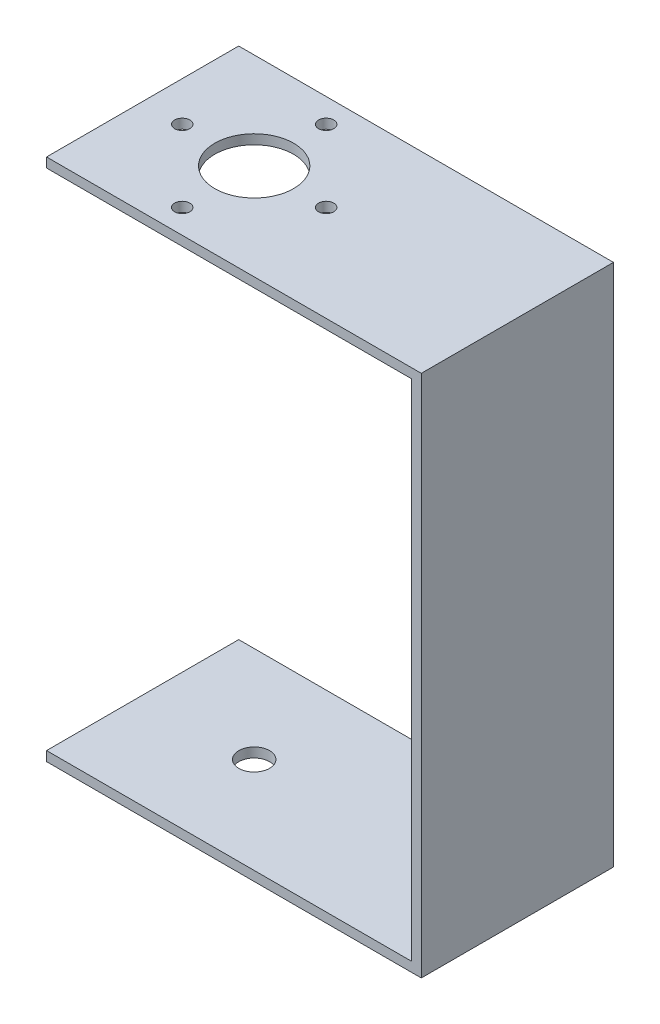
ISO-10303-21;
HEADER;
FILE_DESCRIPTION(('STEP AP214'),'2;1');
FILE_NAME('part.step','',(''),(''),'','','');
FILE_SCHEMA(('AUTOMOTIVE_DESIGN { 1 0 10303 214 1 1 1 1 }'));
ENDSEC;
DATA;
#1=APPLICATION_CONTEXT('core data for automotive mechanical design processes');
#2=APPLICATION_PROTOCOL_DEFINITION('international standard','automotive_design',2000,#1);
#3=PRODUCT_CONTEXT('',#1,'mechanical');
#4=PRODUCT('Part','Part','',(#3));
#5=PRODUCT_RELATED_PRODUCT_CATEGORY('part','',(#4));
#6=PRODUCT_DEFINITION_FORMATION('','',#4);
#7=PRODUCT_DEFINITION_CONTEXT('part definition',#1,'design');
#8=PRODUCT_DEFINITION('design','',#6,#7);
#9=PRODUCT_DEFINITION_SHAPE('','',#8);
#10=(LENGTH_UNIT() NAMED_UNIT(*) SI_UNIT(.MILLI.,.METRE.));
#11=(NAMED_UNIT(*) PLANE_ANGLE_UNIT() SI_UNIT($,.RADIAN.));
#12=(NAMED_UNIT(*) SI_UNIT($,.STERADIAN.) SOLID_ANGLE_UNIT());
#13=UNCERTAINTY_MEASURE_WITH_UNIT(LENGTH_MEASURE(1.E-05),#10,'distance_accuracy_value','');
#14=(GEOMETRIC_REPRESENTATION_CONTEXT(3) GLOBAL_UNCERTAINTY_ASSIGNED_CONTEXT((#13)) GLOBAL_UNIT_ASSIGNED_CONTEXT((#10,
#11,#12)) REPRESENTATION_CONTEXT('',''));
#15=CARTESIAN_POINT('',(0.,0.,0.));
#16=DIRECTION('',(0.,0.,1.));
#17=DIRECTION('',(1.,0.,0.));
#18=AXIS2_PLACEMENT_3D('',#15,#16,#17);
#19=CARTESIAN_POINT('',(0.,0.,0.));
#20=DIRECTION('',(-1.,0.,0.));
#21=DIRECTION('',(0.,0.,1.));
#22=AXIS2_PLACEMENT_3D('',#19,#20,#21);
#23=PLANE('',#22);
#24=DIRECTION('',(0.,1.,0.));
#25=VECTOR('',#24,1.);
#26=CARTESIAN_POINT('',(0.,0.,-20.));
#27=LINE('',#26,#25);
#28=CARTESIAN_POINT('',(0.,0.999999999999998,-20.));
#29=VERTEX_POINT('',#28);
#30=CARTESIAN_POINT('',(0.,53.5,-20.));
#31=VERTEX_POINT('',#30);
#32=EDGE_CURVE('E37',#29,#31,#27,.T.);
#33=ORIENTED_EDGE('',*,*,#32,.F.);
#34=DIRECTION('',(0.,0.,-1.));
#35=VECTOR('',#34,1.);
#36=CARTESIAN_POINT('',(0.,1.,0.));
#37=LINE('',#36,#35);
#38=CARTESIAN_POINT('',(0.,1.,0.));
#39=VERTEX_POINT('',#38);
#40=EDGE_CURVE('E121',#39,#29,#37,.T.);
#41=ORIENTED_EDGE('',*,*,#40,.F.);
#42=DIRECTION('',(0.,-1.,0.));
#43=VECTOR('',#42,1.);
#44=CARTESIAN_POINT('',(0.,0.,0.));
#45=LINE('',#44,#43);
#46=CARTESIAN_POINT('',(0.,53.5,0.));
#47=VERTEX_POINT('',#46);
#48=EDGE_CURVE('E125',#47,#39,#45,.T.);
#49=ORIENTED_EDGE('',*,*,#48,.F.);
#50=DIRECTION('',(0.,0.,1.));
#51=VECTOR('',#50,1.);
#52=CARTESIAN_POINT('',(0.,53.5,-20.));
#53=LINE('',#52,#51);
#54=EDGE_CURVE('E126',#31,#47,#53,.T.);
#55=ORIENTED_EDGE('',*,*,#54,.F.);
#56=EDGE_LOOP('',(#33,#41,#49,#55));
#57=FACE_BOUND('',#56,.T.);
#58=ADVANCED_FACE('F33',(#57),#23,.T.);
#59=CARTESIAN_POINT('',(1.,0.,0.));
#60=DIRECTION('',(0.,0.,-1.));
#61=DIRECTION('',(-1.,0.,0.));
#62=AXIS2_PLACEMENT_3D('',#59,#60,#61);
#63=PLANE('',#62);
#64=DIRECTION('',(-1.,0.,0.));
#65=VECTOR('',#64,1.);
#66=CARTESIAN_POINT('',(1.,54.5,0.));
#67=LINE('',#66,#65);
#68=CARTESIAN_POINT('',(1.,54.5,0.));
#69=VERTEX_POINT('',#68);
#70=CARTESIAN_POINT('',(-38.,54.5,0.));
#71=VERTEX_POINT('',#70);
#72=EDGE_CURVE('E165',#69,#71,#67,.T.);
#73=ORIENTED_EDGE('',*,*,#72,.T.);
#74=DIRECTION('',(0.,1.,0.));
#75=VECTOR('',#74,1.);
#76=CARTESIAN_POINT('',(-38.,54.5,0.));
#77=LINE('',#76,#75);
#78=CARTESIAN_POINT('',(-38.,53.5,0.));
#79=VERTEX_POINT('',#78);
#80=EDGE_CURVE('E138',#79,#71,#77,.T.);
#81=ORIENTED_EDGE('',*,*,#80,.F.);
#82=DIRECTION('',(1.,0.,0.));
#83=VECTOR('',#82,1.);
#84=CARTESIAN_POINT('',(-38.,53.5,0.));
#85=LINE('',#84,#83);
#86=EDGE_CURVE('E144',#79,#47,#85,.T.);
#87=ORIENTED_EDGE('',*,*,#86,.T.);
#88=ORIENTED_EDGE('',*,*,#48,.T.);
#89=DIRECTION('',(1.,0.,0.));
#90=VECTOR('',#89,1.);
#91=CARTESIAN_POINT('',(-38.,1.,0.));
#92=LINE('',#91,#90);
#93=CARTESIAN_POINT('',(-38.,1.,0.));
#94=VERTEX_POINT('',#93);
#95=EDGE_CURVE('E105',#94,#39,#92,.T.);
#96=ORIENTED_EDGE('',*,*,#95,.F.);
#97=DIRECTION('',(0.,1.,0.));
#98=VECTOR('',#97,1.);
#99=CARTESIAN_POINT('',(-38.,0.,0.));
#100=LINE('',#99,#98);
#101=CARTESIAN_POINT('',(-38.,0.,0.));
#102=VERTEX_POINT('',#101);
#103=EDGE_CURVE('E112',#102,#94,#100,.T.);
#104=ORIENTED_EDGE('',*,*,#103,.F.);
#105=DIRECTION('',(-1.,0.,0.));
#106=VECTOR('',#105,1.);
#107=CARTESIAN_POINT('',(1.,0.,0.));
#108=LINE('',#107,#106);
#109=CARTESIAN_POINT('',(1.,0.,0.));
#110=VERTEX_POINT('',#109);
#111=EDGE_CURVE('E11',#110,#102,#108,.T.);
#112=ORIENTED_EDGE('',*,*,#111,.F.);
#113=DIRECTION('',(0.,-1.,0.));
#114=VECTOR('',#113,1.);
#115=CARTESIAN_POINT('',(1.,0.,0.));
#116=LINE('',#115,#114);
#117=EDGE_CURVE('E147',#69,#110,#116,.T.);
#118=ORIENTED_EDGE('',*,*,#117,.F.);
#119=EDGE_LOOP('',(#73,#81,#87,#88,#96,#104,#112,#118));
#120=FACE_BOUND('',#119,.T.);
#121=ADVANCED_FACE('F35',(#120),#63,.F.);
#122=CARTESIAN_POINT('',(1.,0.,0.));
#123=DIRECTION('',(0.,1.,0.));
#124=DIRECTION('',(0.,0.,1.));
#125=AXIS2_PLACEMENT_3D('',#122,#123,#124);
#126=PLANE('',#125);
#127=CARTESIAN_POINT('',(-26.39,0.,-10.));
#128=DIRECTION('',(0.,-1.,0.));
#129=DIRECTION('',(0.,0.,-1.));
#130=AXIS2_PLACEMENT_3D('',#127,#128,#129);
#131=CIRCLE('',#130,1.6);
#132=CARTESIAN_POINT('',(-26.39,0.,-11.6));
#133=VERTEX_POINT('',#132);
#134=EDGE_CURVE('E213',#133,#133,#131,.T.);
#135=ORIENTED_EDGE('',*,*,#134,.F.);
#136=EDGE_LOOP('',(#135));
#137=FACE_BOUND('',#136,.T.);
#138=ORIENTED_EDGE('',*,*,#111,.T.);
#139=DIRECTION('',(0.,0.,1.));
#140=VECTOR('',#139,1.);
#141=CARTESIAN_POINT('',(-38.,0.,0.));
#142=LINE('',#141,#140);
#143=CARTESIAN_POINT('',(-38.,0.,-20.));
#144=VERTEX_POINT('',#143);
#145=EDGE_CURVE('E118',#144,#102,#142,.T.);
#146=ORIENTED_EDGE('',*,*,#145,.F.);
#147=DIRECTION('',(-1.,0.,0.));
#148=VECTOR('',#147,1.);
#149=CARTESIAN_POINT('',(1.,0.,-20.));
#150=LINE('',#149,#148);
#151=CARTESIAN_POINT('',(1.,0.,-20.));
#152=VERTEX_POINT('',#151);
#153=EDGE_CURVE('E43',#152,#144,#150,.T.);
#154=ORIENTED_EDGE('',*,*,#153,.F.);
#155=DIRECTION('',(0.,0.,-1.));
#156=VECTOR('',#155,1.);
#157=CARTESIAN_POINT('',(1.,0.,0.));
#158=LINE('',#157,#156);
#159=EDGE_CURVE('E159',#110,#152,#158,.T.);
#160=ORIENTED_EDGE('',*,*,#159,.F.);
#161=EDGE_LOOP('',(#138,#146,#154,#160));
#162=FACE_BOUND('',#161,.T.);
#163=ADVANCED_FACE('F177',(#137,#162),#126,.F.);
#164=CARTESIAN_POINT('',(1.,0.,-20.));
#165=DIRECTION('',(0.,0.,1.));
#166=DIRECTION('',(1.,0.,0.));
#167=AXIS2_PLACEMENT_3D('',#164,#165,#166);
#168=PLANE('',#167);
#169=ORIENTED_EDGE('',*,*,#153,.T.);
#170=DIRECTION('',(0.,-1.,0.));
#171=VECTOR('',#170,1.);
#172=CARTESIAN_POINT('',(-38.,0.,-20.));
#173=LINE('',#172,#171);
#174=CARTESIAN_POINT('',(-38.,0.999999999999998,-20.));
#175=VERTEX_POINT('',#174);
#176=EDGE_CURVE('E111',#175,#144,#173,.T.);
#177=ORIENTED_EDGE('',*,*,#176,.F.);
#178=DIRECTION('',(1.,0.,0.));
#179=VECTOR('',#178,1.);
#180=CARTESIAN_POINT('',(-38.,0.999999999999998,-20.));
#181=LINE('',#180,#179);
#182=EDGE_CURVE('E107',#175,#29,#181,.T.);
#183=ORIENTED_EDGE('',*,*,#182,.T.);
#184=ORIENTED_EDGE('',*,*,#32,.T.);
#185=DIRECTION('',(1.,0.,0.));
#186=VECTOR('',#185,1.);
#187=CARTESIAN_POINT('',(-38.,53.5,-20.));
#188=LINE('',#187,#186);
#189=CARTESIAN_POINT('',(-38.,53.5,-20.));
#190=VERTEX_POINT('',#189);
#191=EDGE_CURVE('E153',#190,#31,#188,.T.);
#192=ORIENTED_EDGE('',*,*,#191,.F.);
#193=DIRECTION('',(0.,-1.,0.));
#194=VECTOR('',#193,1.);
#195=CARTESIAN_POINT('',(-38.,54.5,-20.));
#196=LINE('',#195,#194);
#197=CARTESIAN_POINT('',(-38.,54.5,-20.));
#198=VERTEX_POINT('',#197);
#199=EDGE_CURVE('E129',#198,#190,#196,.T.);
#200=ORIENTED_EDGE('',*,*,#199,.F.);
#201=DIRECTION('',(-1.,0.,0.));
#202=VECTOR('',#201,1.);
#203=CARTESIAN_POINT('',(1.,54.5,-20.));
#204=LINE('',#203,#202);
#205=CARTESIAN_POINT('',(1.,54.5,-20.));
#206=VERTEX_POINT('',#205);
#207=EDGE_CURVE('E170',#206,#198,#204,.T.);
#208=ORIENTED_EDGE('',*,*,#207,.F.);
#209=DIRECTION('',(0.,1.,0.));
#210=VECTOR('',#209,1.);
#211=CARTESIAN_POINT('',(1.,0.,-20.));
#212=LINE('',#211,#210);
#213=EDGE_CURVE('E161',#152,#206,#212,.T.);
#214=ORIENTED_EDGE('',*,*,#213,.F.);
#215=EDGE_LOOP('',(#169,#177,#183,#184,#192,#200,#208,#214));
#216=FACE_BOUND('',#215,.T.);
#217=ADVANCED_FACE('F173',(#216),#168,.F.);
#218=CARTESIAN_POINT('',(1.,54.5,0.));
#219=DIRECTION('',(0.,-1.,0.));
#220=DIRECTION('',(0.,0.,-1.));
#221=AXIS2_PLACEMENT_3D('',#218,#219,#220);
#222=PLANE('',#221);
#223=CARTESIAN_POINT('',(-26.39,54.5,-17.49));
#224=DIRECTION('',(0.,1.,0.));
#225=DIRECTION('',(0.,0.,1.));
#226=AXIS2_PLACEMENT_3D('',#223,#224,#225);
#227=CIRCLE('',#226,0.789999999999999);
#228=CARTESIAN_POINT('',(-26.39,54.5,-16.7));
#229=VERTEX_POINT('',#228);
#230=EDGE_CURVE('E207',#229,#229,#227,.T.);
#231=ORIENTED_EDGE('',*,*,#230,.F.);
#232=EDGE_LOOP('',(#231));
#233=FACE_BOUND('',#232,.T.);
#234=CARTESIAN_POINT('',(-26.39,54.5,-2.51));
#235=DIRECTION('',(0.,1.,0.));
#236=DIRECTION('',(0.,0.,1.));
#237=AXIS2_PLACEMENT_3D('',#234,#235,#236);
#238=CIRCLE('',#237,0.789999999999999);
#239=CARTESIAN_POINT('',(-26.39,54.5,-1.72));
#240=VERTEX_POINT('',#239);
#241=EDGE_CURVE('E201',#240,#240,#238,.T.);
#242=ORIENTED_EDGE('',*,*,#241,.F.);
#243=EDGE_LOOP('',(#242));
#244=FACE_BOUND('',#243,.T.);
#245=CARTESIAN_POINT('',(-18.9,54.5,-10.));
#246=DIRECTION('',(0.,1.,0.));
#247=DIRECTION('',(0.,0.,1.));
#248=AXIS2_PLACEMENT_3D('',#245,#246,#247);
#249=CIRCLE('',#248,0.790000000000002);
#250=CARTESIAN_POINT('',(-18.9,54.5,-9.21));
#251=VERTEX_POINT('',#250);
#252=EDGE_CURVE('E195',#251,#251,#249,.T.);
#253=ORIENTED_EDGE('',*,*,#252,.F.);
#254=EDGE_LOOP('',(#253));
#255=FACE_BOUND('',#254,.T.);
#256=CARTESIAN_POINT('',(-33.88,54.5,-10.));
#257=DIRECTION('',(0.,1.,0.));
#258=DIRECTION('',(0.,0.,1.));
#259=AXIS2_PLACEMENT_3D('',#256,#257,#258);
#260=CIRCLE('',#259,0.789999999999999);
#261=CARTESIAN_POINT('',(-33.88,54.5,-9.21));
#262=VERTEX_POINT('',#261);
#263=EDGE_CURVE('E189',#262,#262,#260,.T.);
#264=ORIENTED_EDGE('',*,*,#263,.F.);
#265=EDGE_LOOP('',(#264));
#266=FACE_BOUND('',#265,.T.);
#267=CARTESIAN_POINT('',(-26.39,54.5,-10.));
#268=DIRECTION('',(0.,1.,0.));
#269=DIRECTION('',(0.,0.,1.));
#270=AXIS2_PLACEMENT_3D('',#267,#268,#269);
#271=CIRCLE('',#270,4.1);
#272=CARTESIAN_POINT('',(-26.39,54.5,-5.9));
#273=VERTEX_POINT('',#272);
#274=EDGE_CURVE('E181',#273,#273,#271,.T.);
#275=ORIENTED_EDGE('',*,*,#274,.F.);
#276=EDGE_LOOP('',(#275));
#277=FACE_BOUND('',#276,.T.);
#278=ORIENTED_EDGE('',*,*,#207,.T.);
#279=DIRECTION('',(0.,0.,-1.));
#280=VECTOR('',#279,1.);
#281=CARTESIAN_POINT('',(-38.,54.5,-20.));
#282=LINE('',#281,#280);
#283=EDGE_CURVE('E141',#71,#198,#282,.T.);
#284=ORIENTED_EDGE('',*,*,#283,.F.);
#285=ORIENTED_EDGE('',*,*,#72,.F.);
#286=DIRECTION('',(0.,0.,1.));
#287=VECTOR('',#286,1.);
#288=CARTESIAN_POINT('',(1.,54.5,0.));
#289=LINE('',#288,#287);
#290=EDGE_CURVE('E58',#206,#69,#289,.T.);
#291=ORIENTED_EDGE('',*,*,#290,.F.);
#292=EDGE_LOOP('',(#278,#284,#285,#291));
#293=FACE_BOUND('',#292,.T.);
#294=ADVANCED_FACE('F232',(#233,#244,#255,#266,#277,#293),#222,.F.);
#295=CARTESIAN_POINT('',(1.,0.,0.));
#296=DIRECTION('',(-1.,0.,0.));
#297=DIRECTION('',(0.,0.,1.));
#298=AXIS2_PLACEMENT_3D('',#295,#296,#297);
#299=PLANE('',#298);
#300=ORIENTED_EDGE('',*,*,#117,.T.);
#301=ORIENTED_EDGE('',*,*,#159,.T.);
#302=ORIENTED_EDGE('',*,*,#213,.T.);
#303=ORIENTED_EDGE('',*,*,#290,.T.);
#304=EDGE_LOOP('',(#300,#301,#302,#303));
#305=FACE_BOUND('',#304,.T.);
#306=ADVANCED_FACE('F241',(#305),#299,.F.);
#307=CARTESIAN_POINT('',(-38.,53.5,-20.));
#308=DIRECTION('',(0.,1.,0.));
#309=DIRECTION('',(0.,0.,1.));
#310=AXIS2_PLACEMENT_3D('',#307,#308,#309);
#311=PLANE('',#310);
#312=CARTESIAN_POINT('',(-26.39,53.5,-17.49));
#313=DIRECTION('',(0.,1.,0.));
#314=DIRECTION('',(0.,0.,1.));
#315=AXIS2_PLACEMENT_3D('',#312,#313,#314);
#316=CIRCLE('',#315,0.789999999999999);
#317=CARTESIAN_POINT('',(-26.39,53.5,-16.7));
#318=VERTEX_POINT('',#317);
#319=EDGE_CURVE('E204',#318,#318,#316,.T.);
#320=ORIENTED_EDGE('',*,*,#319,.T.);
#321=EDGE_LOOP('',(#320));
#322=FACE_BOUND('',#321,.T.);
#323=CARTESIAN_POINT('',(-26.39,53.5,-2.51));
#324=DIRECTION('',(0.,1.,0.));
#325=DIRECTION('',(0.,0.,1.));
#326=AXIS2_PLACEMENT_3D('',#323,#324,#325);
#327=CIRCLE('',#326,0.789999999999999);
#328=CARTESIAN_POINT('',(-26.39,53.5,-1.72));
#329=VERTEX_POINT('',#328);
#330=EDGE_CURVE('E198',#329,#329,#327,.T.);
#331=ORIENTED_EDGE('',*,*,#330,.T.);
#332=EDGE_LOOP('',(#331));
#333=FACE_BOUND('',#332,.T.);
#334=CARTESIAN_POINT('',(-18.9,53.5,-10.));
#335=DIRECTION('',(0.,1.,0.));
#336=DIRECTION('',(0.,0.,1.));
#337=AXIS2_PLACEMENT_3D('',#334,#335,#336);
#338=CIRCLE('',#337,0.790000000000002);
#339=CARTESIAN_POINT('',(-18.9,53.5,-9.21));
#340=VERTEX_POINT('',#339);
#341=EDGE_CURVE('E192',#340,#340,#338,.T.);
#342=ORIENTED_EDGE('',*,*,#341,.T.);
#343=EDGE_LOOP('',(#342));
#344=FACE_BOUND('',#343,.T.);
#345=CARTESIAN_POINT('',(-33.88,53.5,-10.));
#346=DIRECTION('',(0.,1.,0.));
#347=DIRECTION('',(0.,0.,1.));
#348=AXIS2_PLACEMENT_3D('',#345,#346,#347);
#349=CIRCLE('',#348,0.789999999999999);
#350=CARTESIAN_POINT('',(-33.88,53.5,-9.21));
#351=VERTEX_POINT('',#350);
#352=EDGE_CURVE('E186',#351,#351,#349,.T.);
#353=ORIENTED_EDGE('',*,*,#352,.T.);
#354=EDGE_LOOP('',(#353));
#355=FACE_BOUND('',#354,.T.);
#356=CARTESIAN_POINT('',(-26.39,53.5,-10.));
#357=DIRECTION('',(0.,1.,0.));
#358=DIRECTION('',(0.,0.,1.));
#359=AXIS2_PLACEMENT_3D('',#356,#357,#358);
#360=CIRCLE('',#359,4.1);
#361=CARTESIAN_POINT('',(-26.39,53.5,-5.9));
#362=VERTEX_POINT('',#361);
#363=EDGE_CURVE('E179',#362,#362,#360,.T.);
#364=ORIENTED_EDGE('',*,*,#363,.T.);
#365=EDGE_LOOP('',(#364));
#366=FACE_BOUND('',#365,.T.);
#367=ORIENTED_EDGE('',*,*,#54,.T.);
#368=ORIENTED_EDGE('',*,*,#86,.F.);
#369=DIRECTION('',(0.,0.,1.));
#370=VECTOR('',#369,1.);
#371=CARTESIAN_POINT('',(-38.,53.5,-20.));
#372=LINE('',#371,#370);
#373=EDGE_CURVE('E136',#190,#79,#372,.T.);
#374=ORIENTED_EDGE('',*,*,#373,.F.);
#375=ORIENTED_EDGE('',*,*,#191,.T.);
#376=EDGE_LOOP('',(#367,#368,#374,#375));
#377=FACE_BOUND('',#376,.T.);
#378=ADVANCED_FACE('F248',(#322,#333,#344,#355,#366,#377),#311,.F.);
#379=CARTESIAN_POINT('',(-38.,0.,0.));
#380=DIRECTION('',(-1.,0.,0.));
#381=DIRECTION('',(0.,0.,1.));
#382=AXIS2_PLACEMENT_3D('',#379,#380,#381);
#383=PLANE('',#382);
#384=ORIENTED_EDGE('',*,*,#199,.T.);
#385=ORIENTED_EDGE('',*,*,#373,.T.);
#386=ORIENTED_EDGE('',*,*,#80,.T.);
#387=ORIENTED_EDGE('',*,*,#283,.T.);
#388=EDGE_LOOP('',(#384,#385,#386,#387));
#389=FACE_BOUND('',#388,.T.);
#390=ADVANCED_FACE('F262',(#389),#383,.T.);
#391=CARTESIAN_POINT('',(-38.,1.,0.));
#392=DIRECTION('',(0.,-1.,0.));
#393=DIRECTION('',(0.,0.,-1.));
#394=AXIS2_PLACEMENT_3D('',#391,#392,#393);
#395=PLANE('',#394);
#396=CARTESIAN_POINT('',(-26.39,1.,-10.));
#397=DIRECTION('',(0.,-1.,0.));
#398=DIRECTION('',(0.,0.,-1.));
#399=AXIS2_PLACEMENT_3D('',#396,#397,#398);
#400=CIRCLE('',#399,1.6);
#401=CARTESIAN_POINT('',(-26.39,1.,-11.6));
#402=VERTEX_POINT('',#401);
#403=EDGE_CURVE('E210',#402,#402,#400,.T.);
#404=ORIENTED_EDGE('',*,*,#403,.T.);
#405=EDGE_LOOP('',(#404));
#406=FACE_BOUND('',#405,.T.);
#407=ORIENTED_EDGE('',*,*,#40,.T.);
#408=ORIENTED_EDGE('',*,*,#182,.F.);
#409=DIRECTION('',(0.,0.,-1.));
#410=VECTOR('',#409,1.);
#411=CARTESIAN_POINT('',(-38.,1.,0.));
#412=LINE('',#411,#410);
#413=EDGE_CURVE('E101',#94,#175,#412,.T.);
#414=ORIENTED_EDGE('',*,*,#413,.F.);
#415=ORIENTED_EDGE('',*,*,#95,.T.);
#416=EDGE_LOOP('',(#407,#408,#414,#415));
#417=FACE_BOUND('',#416,.T.);
#418=ADVANCED_FACE('F103',(#406,#417),#395,.F.);
#419=CARTESIAN_POINT('',(-38.,0.,0.));
#420=DIRECTION('',(-1.,0.,0.));
#421=DIRECTION('',(0.,0.,1.));
#422=AXIS2_PLACEMENT_3D('',#419,#420,#421);
#423=PLANE('',#422);
#424=ORIENTED_EDGE('',*,*,#103,.T.);
#425=ORIENTED_EDGE('',*,*,#413,.T.);
#426=ORIENTED_EDGE('',*,*,#176,.T.);
#427=ORIENTED_EDGE('',*,*,#145,.T.);
#428=EDGE_LOOP('',(#424,#425,#426,#427));
#429=FACE_BOUND('',#428,.T.);
#430=ADVANCED_FACE('F116',(#429),#423,.T.);
#431=CARTESIAN_POINT('',(-26.39,53.5,-10.));
#432=DIRECTION('',(0.,1.,0.));
#433=DIRECTION('',(0.,0.,1.));
#434=AXIS2_PLACEMENT_3D('',#431,#432,#433);
#435=CYLINDRICAL_SURFACE('',#434,4.1);
#436=ORIENTED_EDGE('',*,*,#363,.F.);
#437=EDGE_LOOP('',(#436));
#438=FACE_BOUND('',#437,.T.);
#439=ORIENTED_EDGE('',*,*,#274,.T.);
#440=EDGE_LOOP('',(#439));
#441=FACE_BOUND('',#440,.T.);
#442=ADVANCED_FACE('F277',(#438,#441),#435,.F.);
#443=CARTESIAN_POINT('',(-33.88,53.5,-10.));
#444=DIRECTION('',(0.,1.,0.));
#445=DIRECTION('',(0.,0.,1.));
#446=AXIS2_PLACEMENT_3D('',#443,#444,#445);
#447=CYLINDRICAL_SURFACE('',#446,0.789999999999999);
#448=ORIENTED_EDGE('',*,*,#352,.F.);
#449=EDGE_LOOP('',(#448));
#450=FACE_BOUND('',#449,.T.);
#451=ORIENTED_EDGE('',*,*,#263,.T.);
#452=EDGE_LOOP('',(#451));
#453=FACE_BOUND('',#452,.T.);
#454=ADVANCED_FACE('F280',(#450,#453),#447,.F.);
#455=CARTESIAN_POINT('',(-18.9,53.5,-10.));
#456=DIRECTION('',(0.,1.,0.));
#457=DIRECTION('',(0.,0.,1.));
#458=AXIS2_PLACEMENT_3D('',#455,#456,#457);
#459=CYLINDRICAL_SURFACE('',#458,0.790000000000002);
#460=ORIENTED_EDGE('',*,*,#341,.F.);
#461=EDGE_LOOP('',(#460));
#462=FACE_BOUND('',#461,.T.);
#463=ORIENTED_EDGE('',*,*,#252,.T.);
#464=EDGE_LOOP('',(#463));
#465=FACE_BOUND('',#464,.T.);
#466=ADVANCED_FACE('F284',(#462,#465),#459,.F.);
#467=CARTESIAN_POINT('',(-26.39,53.5,-2.51));
#468=DIRECTION('',(0.,1.,0.));
#469=DIRECTION('',(0.,0.,1.));
#470=AXIS2_PLACEMENT_3D('',#467,#468,#469);
#471=CYLINDRICAL_SURFACE('',#470,0.789999999999999);
#472=ORIENTED_EDGE('',*,*,#330,.F.);
#473=EDGE_LOOP('',(#472));
#474=FACE_BOUND('',#473,.T.);
#475=ORIENTED_EDGE('',*,*,#241,.T.);
#476=EDGE_LOOP('',(#475));
#477=FACE_BOUND('',#476,.T.);
#478=ADVANCED_FACE('F288',(#474,#477),#471,.F.);
#479=CARTESIAN_POINT('',(-26.39,53.5,-17.49));
#480=DIRECTION('',(0.,1.,0.));
#481=DIRECTION('',(0.,0.,1.));
#482=AXIS2_PLACEMENT_3D('',#479,#480,#481);
#483=CYLINDRICAL_SURFACE('',#482,0.789999999999999);
#484=ORIENTED_EDGE('',*,*,#319,.F.);
#485=EDGE_LOOP('',(#484));
#486=FACE_BOUND('',#485,.T.);
#487=ORIENTED_EDGE('',*,*,#230,.T.);
#488=EDGE_LOOP('',(#487));
#489=FACE_BOUND('',#488,.T.);
#490=ADVANCED_FACE('F223',(#486,#489),#483,.F.);
#491=CARTESIAN_POINT('',(-26.39,1.,-10.));
#492=DIRECTION('',(0.,-1.,0.));
#493=DIRECTION('',(0.,0.,-1.));
#494=AXIS2_PLACEMENT_3D('',#491,#492,#493);
#495=CYLINDRICAL_SURFACE('',#494,1.6);
#496=ORIENTED_EDGE('',*,*,#403,.F.);
#497=EDGE_LOOP('',(#496));
#498=FACE_BOUND('',#497,.T.);
#499=ORIENTED_EDGE('',*,*,#134,.T.);
#500=EDGE_LOOP('',(#499));
#501=FACE_BOUND('',#500,.T.);
#502=ADVANCED_FACE('F220',(#498,#501),#495,.F.);
#503=CLOSED_SHELL('',(#58,#121,#163,#217,#294,#306,#378,#390,#418,#430,#442,#454,#466,#478,#490,#502));
#504=MANIFOLD_SOLID_BREP('B2',#503);
#505=ADVANCED_BREP_SHAPE_REPRESENTATION('',(#18,#504),#14);
#506=SHAPE_DEFINITION_REPRESENTATION(#9,#505);
ENDSEC;
END-ISO-10303-21;
